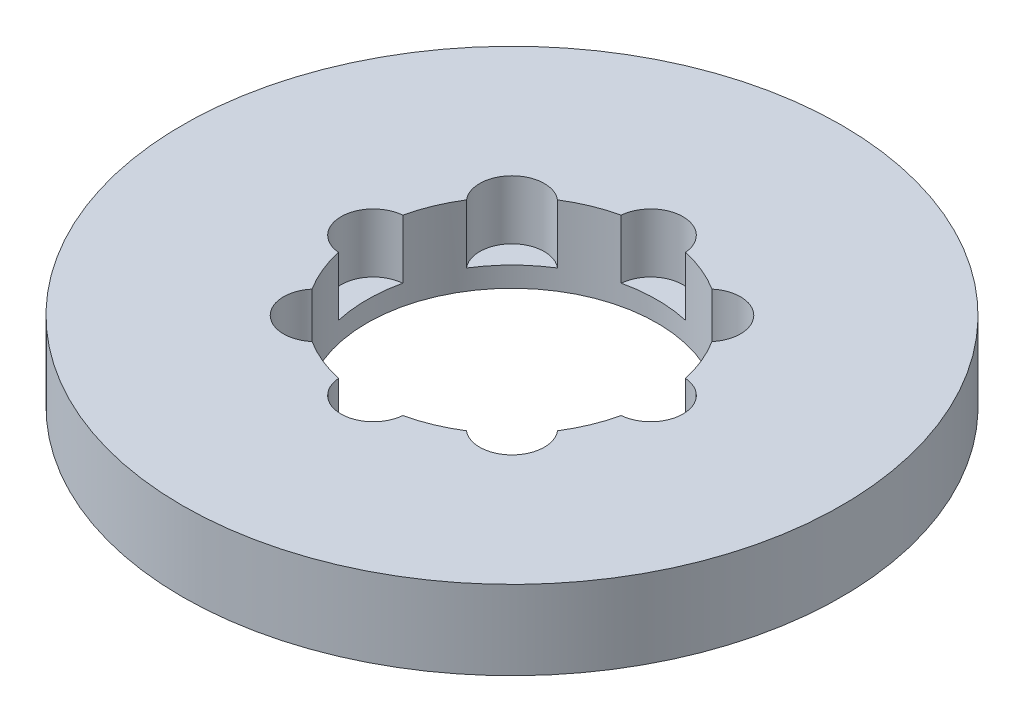
ISO-10303-21;
HEADER;
FILE_DESCRIPTION(('STEP AP214'),'2;1');
FILE_NAME('part.step','',(''),(''),'','','');
FILE_SCHEMA(('AUTOMOTIVE_DESIGN { 1 0 10303 214 1 1 1 1 }'));
ENDSEC;
DATA;
#1=APPLICATION_CONTEXT('core data for automotive mechanical design processes');
#2=APPLICATION_PROTOCOL_DEFINITION('international standard','automotive_design',2000,#1);
#3=PRODUCT_CONTEXT('',#1,'mechanical');
#4=PRODUCT('Part','Part','',(#3));
#5=PRODUCT_RELATED_PRODUCT_CATEGORY('part','',(#4));
#6=PRODUCT_DEFINITION_FORMATION('','',#4);
#7=PRODUCT_DEFINITION_CONTEXT('part definition',#1,'design');
#8=PRODUCT_DEFINITION('design','',#6,#7);
#9=PRODUCT_DEFINITION_SHAPE('','',#8);
#10=(LENGTH_UNIT() NAMED_UNIT(*) SI_UNIT(.MILLI.,.METRE.));
#11=(NAMED_UNIT(*) PLANE_ANGLE_UNIT() SI_UNIT($,.RADIAN.));
#12=(NAMED_UNIT(*) SI_UNIT($,.STERADIAN.) SOLID_ANGLE_UNIT());
#13=UNCERTAINTY_MEASURE_WITH_UNIT(LENGTH_MEASURE(1.E-05),#10,'distance_accuracy_value','');
#14=(GEOMETRIC_REPRESENTATION_CONTEXT(3) GLOBAL_UNCERTAINTY_ASSIGNED_CONTEXT((#13)) GLOBAL_UNIT_ASSIGNED_CONTEXT((#10,
#11,#12)) REPRESENTATION_CONTEXT('',''));
#15=CARTESIAN_POINT('',(0.,0.,0.));
#16=DIRECTION('',(0.,0.,1.));
#17=DIRECTION('',(1.,0.,0.));
#18=AXIS2_PLACEMENT_3D('',#15,#16,#17);
#19=CARTESIAN_POINT('',(0.,15.,0.));
#20=DIRECTION('',(0.,-1.,0.));
#21=DIRECTION('',(0.,0.,-1.));
#22=AXIS2_PLACEMENT_3D('',#19,#20,#21);
#23=CYLINDRICAL_SURFACE('',#22,62.5);
#24=CARTESIAN_POINT('',(0.,15.,0.));
#25=DIRECTION('',(0.,1.,0.));
#26=DIRECTION('',(0.,0.,1.));
#27=AXIS2_PLACEMENT_3D('',#24,#25,#26);
#28=CIRCLE('',#27,62.5);
#29=CARTESIAN_POINT('',(0.,15.,62.5));
#30=VERTEX_POINT('',#29);
#31=EDGE_CURVE('E183',#30,#30,#28,.T.);
#32=ORIENTED_EDGE('',*,*,#31,.F.);
#33=EDGE_LOOP('',(#32));
#34=FACE_BOUND('',#33,.T.);
#35=CARTESIAN_POINT('',(0.,0.,0.));
#36=DIRECTION('',(0.,1.,0.));
#37=DIRECTION('',(0.,0.,1.));
#38=AXIS2_PLACEMENT_3D('',#35,#36,#37);
#39=CIRCLE('',#38,62.5);
#40=CARTESIAN_POINT('',(0.,0.,62.5));
#41=VERTEX_POINT('',#40);
#42=EDGE_CURVE('E182',#41,#41,#39,.T.);
#43=ORIENTED_EDGE('',*,*,#42,.T.);
#44=EDGE_LOOP('',(#43));
#45=FACE_BOUND('',#44,.T.);
#46=ADVANCED_FACE('F39',(#34,#45),#23,.T.);
#47=CARTESIAN_POINT('',(0.,15.,0.));
#48=DIRECTION('',(0.,1.,0.));
#49=DIRECTION('',(0.,0.,1.));
#50=AXIS2_PLACEMENT_3D('',#47,#48,#49);
#51=PLANE('',#50);
#52=CARTESIAN_POINT('',(0.,15.,26.300983409731));
#53=DIRECTION('',(0.,1.,0.));
#54=DIRECTION('',(1.,0.,0.));
#55=AXIS2_PLACEMENT_3D('',#52,#53,#54);
#56=CIRCLE('',#55,6.12444442520899);
#57=CARTESIAN_POINT('',(-6.10289806772411,15.,26.8142617868732));
#58=VERTEX_POINT('',#57);
#59=CARTESIAN_POINT('',(6.10289806772429,15.,26.8142617868732));
#60=VERTEX_POINT('',#59);
#61=EDGE_CURVE('E256',#58,#60,#56,.T.);
#62=ORIENTED_EDGE('',*,*,#61,.F.);
#63=CARTESIAN_POINT('',(0.,15.,0.));
#64=DIRECTION('',(0.,1.,0.));
#65=DIRECTION('',(0.,0.,1.));
#66=AXIS2_PLACEMENT_3D('',#63,#64,#65);
#67=CIRCLE('',#66,27.5);
#68=CARTESIAN_POINT('',(-14.6451457334312,15.,23.2759469505874));
#69=VERTEX_POINT('',#68);
#70=EDGE_CURVE('E175',#69,#58,#67,.T.);
#71=ORIENTED_EDGE('',*,*,#70,.F.);
#72=CARTESIAN_POINT('',(-18.5976037208956,15.,18.5976037208957));
#73=DIRECTION('',(0.,1.,0.));
#74=DIRECTION('',(0.707106781186549,0.,0.707106781186546));
#75=AXIS2_PLACEMENT_3D('',#72,#73,#74);
#76=CIRCLE('',#75,6.12444442520899);
#77=CARTESIAN_POINT('',(-23.2759469505874,15.,14.6451457334313));
#78=VERTEX_POINT('',#77);
#79=EDGE_CURVE('E152',#78,#69,#76,.T.);
#80=ORIENTED_EDGE('',*,*,#79,.F.);
#81=CARTESIAN_POINT('',(-26.8142617868732,15.,6.1028980677242));
#82=VERTEX_POINT('',#81);
#83=EDGE_CURVE('E168',#82,#78,#67,.T.);
#84=ORIENTED_EDGE('',*,*,#83,.F.);
#85=CARTESIAN_POINT('',(-26.300983409731,15.,0.));
#86=DIRECTION('',(0.,1.,0.));
#87=DIRECTION('',(0.,0.,1.));
#88=AXIS2_PLACEMENT_3D('',#85,#86,#87);
#89=CIRCLE('',#88,6.12444442520899);
#90=CARTESIAN_POINT('',(-26.8142617868732,15.,-6.1028980677242));
#91=VERTEX_POINT('',#90);
#92=EDGE_CURVE('E205',#91,#82,#89,.T.);
#93=ORIENTED_EDGE('',*,*,#92,.F.);
#94=CARTESIAN_POINT('',(-23.2759469505876,15.,-14.645145733431));
#95=VERTEX_POINT('',#94);
#96=EDGE_CURVE('E181',#95,#91,#67,.T.);
#97=ORIENTED_EDGE('',*,*,#96,.F.);
#98=CARTESIAN_POINT('',(-18.5976037208959,15.,-18.5976037208955));
#99=DIRECTION('',(0.,1.,0.));
#100=DIRECTION('',(-0.707106781186539,0.,0.707106781186556));
#101=AXIS2_PLACEMENT_3D('',#98,#99,#100);
#102=CIRCLE('',#101,6.12444442520899);
#103=CARTESIAN_POINT('',(-14.6451457334316,15.,-23.2759469505872));
#104=VERTEX_POINT('',#103);
#105=EDGE_CURVE('E453',#104,#95,#102,.T.);
#106=ORIENTED_EDGE('',*,*,#105,.F.);
#107=CARTESIAN_POINT('',(-6.10289806772448,15.,-26.8142617868731));
#108=VERTEX_POINT('',#107);
#109=EDGE_CURVE('E189',#108,#104,#67,.T.);
#110=ORIENTED_EDGE('',*,*,#109,.F.);
#111=CARTESIAN_POINT('',(-2.75488178304896E-13,15.,-26.300983409731));
#112=DIRECTION('',(0.,1.,0.));
#113=DIRECTION('',(-1.,0.,0.));
#114=AXIS2_PLACEMENT_3D('',#111,#112,#113);
#115=CIRCLE('',#114,6.12444442520899);
#116=CARTESIAN_POINT('',(6.10289806772392,15.,-26.8142617868733));
#117=VERTEX_POINT('',#116);
#118=EDGE_CURVE('E462',#117,#108,#115,.T.);
#119=ORIENTED_EDGE('',*,*,#118,.F.);
#120=CARTESIAN_POINT('',(14.6451457334311,15.,-23.2759469505875));
#121=VERTEX_POINT('',#120);
#122=EDGE_CURVE('E197',#121,#117,#67,.T.);
#123=ORIENTED_EDGE('',*,*,#122,.F.);
#124=CARTESIAN_POINT('',(18.5976037208955,15.,-18.5976037208958));
#125=DIRECTION('',(0.,1.,0.));
#126=DIRECTION('',(-0.707106781186554,0.,-0.707106781186541));
#127=AXIS2_PLACEMENT_3D('',#124,#125,#126);
#128=CIRCLE('',#127,6.12444442520899);
#129=CARTESIAN_POINT('',(23.2759469505873,15.,-14.6451457334315));
#130=VERTEX_POINT('',#129);
#131=EDGE_CURVE('E470',#130,#121,#128,.T.);
#132=ORIENTED_EDGE('',*,*,#131,.F.);
#133=CARTESIAN_POINT('',(26.8142617868732,15.,-6.1028980677242));
#134=VERTEX_POINT('',#133);
#135=EDGE_CURVE('E489',#134,#130,#67,.T.);
#136=ORIENTED_EDGE('',*,*,#135,.F.);
#137=CARTESIAN_POINT('',(26.300983409731,15.,0.));
#138=DIRECTION('',(0.,1.,0.));
#139=DIRECTION('',(0.,0.,-1.));
#140=AXIS2_PLACEMENT_3D('',#137,#138,#139);
#141=CIRCLE('',#140,6.12444442520899);
#142=CARTESIAN_POINT('',(26.8142617868732,15.,6.1028980677242));
#143=VERTEX_POINT('',#142);
#144=EDGE_CURVE('E476',#143,#134,#141,.T.);
#145=ORIENTED_EDGE('',*,*,#144,.F.);
#146=CARTESIAN_POINT('',(23.2759469505875,15.,14.6451457334312));
#147=VERTEX_POINT('',#146);
#148=EDGE_CURVE('E491',#147,#143,#67,.T.);
#149=ORIENTED_EDGE('',*,*,#148,.F.);
#150=CARTESIAN_POINT('',(18.5976037208958,15.,18.5976037208956));
#151=DIRECTION('',(0.,1.,0.));
#152=DIRECTION('',(0.707106781186544,0.,-0.707106781186551));
#153=AXIS2_PLACEMENT_3D('',#150,#151,#152);
#154=CIRCLE('',#153,6.12444442520899);
#155=CARTESIAN_POINT('',(14.6451457334314,15.,23.2759469505873));
#156=VERTEX_POINT('',#155);
#157=EDGE_CURVE('E475',#156,#147,#154,.T.);
#158=ORIENTED_EDGE('',*,*,#157,.F.);
#159=EDGE_CURVE('E190',#60,#156,#67,.T.);
#160=ORIENTED_EDGE('',*,*,#159,.F.);
#161=EDGE_LOOP('',(#62,#71,#80,#84,#93,#97,#106,#110,#119,#123,#132,#136,#145,#149,#158,#160));
#162=FACE_BOUND('',#161,.T.);
#163=ORIENTED_EDGE('',*,*,#31,.T.);
#164=EDGE_LOOP('',(#163));
#165=FACE_BOUND('',#164,.T.);
#166=ADVANCED_FACE('F170',(#162,#165),#51,.T.);
#167=CARTESIAN_POINT('',(0.,0.,0.));
#168=DIRECTION('',(0.,1.,0.));
#169=DIRECTION('',(0.,0.,1.));
#170=AXIS2_PLACEMENT_3D('',#167,#168,#169);
#171=PLANE('',#170);
#172=CARTESIAN_POINT('',(0.,0.,0.));
#173=DIRECTION('',(0.,1.,0.));
#174=DIRECTION('',(0.,0.,1.));
#175=AXIS2_PLACEMENT_3D('',#172,#173,#174);
#176=CIRCLE('',#175,27.5);
#177=CARTESIAN_POINT('',(0.,0.,27.5));
#178=VERTEX_POINT('',#177);
#179=EDGE_CURVE('E191',#178,#178,#176,.T.);
#180=ORIENTED_EDGE('',*,*,#179,.T.);
#181=EDGE_LOOP('',(#180));
#182=FACE_BOUND('',#181,.T.);
#183=ORIENTED_EDGE('',*,*,#42,.F.);
#184=EDGE_LOOP('',(#183));
#185=FACE_BOUND('',#184,.T.);
#186=ADVANCED_FACE('F277',(#182,#185),#171,.F.);
#187=CARTESIAN_POINT('',(0.,15.,0.));
#188=DIRECTION('',(0.,-1.,0.));
#189=DIRECTION('',(0.,0.,-1.));
#190=AXIS2_PLACEMENT_3D('',#187,#188,#189);
#191=CYLINDRICAL_SURFACE('',#190,27.5);
#192=DIRECTION('',(0.,1.,0.));
#193=VECTOR('',#192,1.);
#194=CARTESIAN_POINT('',(-6.10289806772411,9.40940840713012,26.8142617868732));
#195=LINE('',#194,#193);
#196=CARTESIAN_POINT('',(-6.10289806772411,3.81881681426024,26.8142617868732));
#197=VERTEX_POINT('',#196);
#198=EDGE_CURVE('E11',#197,#58,#195,.T.);
#199=ORIENTED_EDGE('',*,*,#198,.F.);
#200=CARTESIAN_POINT('',(0.,3.81881681426024,0.));
#201=DIRECTION('',(0.,1.,0.));
#202=DIRECTION('',(0.,0.,1.));
#203=AXIS2_PLACEMENT_3D('',#200,#201,#202);
#204=CIRCLE('',#203,27.5);
#205=CARTESIAN_POINT('',(6.10289806772429,3.81881681426024,26.8142617868732));
#206=VERTEX_POINT('',#205);
#207=EDGE_CURVE('E251',#197,#206,#204,.T.);
#208=ORIENTED_EDGE('',*,*,#207,.T.);
#209=DIRECTION('',(0.,1.,0.));
#210=VECTOR('',#209,1.);
#211=CARTESIAN_POINT('',(6.10289806772429,9.40940840713012,26.8142617868732));
#212=LINE('',#211,#210);
#213=EDGE_CURVE('E46',#60,#206,#212,.F.);
#214=ORIENTED_EDGE('',*,*,#213,.F.);
#215=ORIENTED_EDGE('',*,*,#159,.T.);
#216=DIRECTION('',(0.,1.,0.));
#217=VECTOR('',#216,1.);
#218=CARTESIAN_POINT('',(14.6451457334314,9.40940840713012,23.2759469505873));
#219=LINE('',#218,#217);
#220=CARTESIAN_POINT('',(14.6451457334314,3.81881681426024,23.2759469505873));
#221=VERTEX_POINT('',#220);
#222=EDGE_CURVE('E253',#221,#156,#219,.T.);
#223=ORIENTED_EDGE('',*,*,#222,.F.);
#224=CARTESIAN_POINT('',(0.,3.81881681426024,0.));
#225=DIRECTION('',(0.,1.,0.));
#226=DIRECTION('',(0.,0.,1.));
#227=AXIS2_PLACEMENT_3D('',#224,#225,#226);
#228=CIRCLE('',#227,27.5);
#229=CARTESIAN_POINT('',(23.2759469505875,3.81881681426024,14.6451457334312));
#230=VERTEX_POINT('',#229);
#231=EDGE_CURVE('E246',#221,#230,#228,.T.);
#232=ORIENTED_EDGE('',*,*,#231,.T.);
#233=DIRECTION('',(0.,1.,0.));
#234=VECTOR('',#233,1.);
#235=CARTESIAN_POINT('',(23.2759469505875,9.40940840713012,14.6451457334312));
#236=LINE('',#235,#234);
#237=EDGE_CURVE('E248',#147,#230,#236,.F.);
#238=ORIENTED_EDGE('',*,*,#237,.F.);
#239=ORIENTED_EDGE('',*,*,#148,.T.);
#240=DIRECTION('',(0.,1.,0.));
#241=VECTOR('',#240,1.);
#242=CARTESIAN_POINT('',(26.8142617868732,9.40940840713012,6.1028980677242));
#243=LINE('',#242,#241);
#244=CARTESIAN_POINT('',(26.8142617868732,3.81881681426024,6.1028980677242));
#245=VERTEX_POINT('',#244);
#246=EDGE_CURVE('E243',#245,#143,#243,.T.);
#247=ORIENTED_EDGE('',*,*,#246,.F.);
#248=CARTESIAN_POINT('',(0.,3.81881681426024,0.));
#249=DIRECTION('',(0.,1.,0.));
#250=DIRECTION('',(0.,0.,1.));
#251=AXIS2_PLACEMENT_3D('',#248,#249,#250);
#252=CIRCLE('',#251,27.5);
#253=CARTESIAN_POINT('',(26.8142617868732,3.81881681426024,-6.1028980677242));
#254=VERTEX_POINT('',#253);
#255=EDGE_CURVE('E236',#245,#254,#252,.T.);
#256=ORIENTED_EDGE('',*,*,#255,.T.);
#257=DIRECTION('',(0.,1.,0.));
#258=VECTOR('',#257,1.);
#259=CARTESIAN_POINT('',(26.8142617868732,9.40940840713012,-6.1028980677242));
#260=LINE('',#259,#258);
#261=EDGE_CURVE('E241',#134,#254,#260,.F.);
#262=ORIENTED_EDGE('',*,*,#261,.F.);
#263=ORIENTED_EDGE('',*,*,#135,.T.);
#264=DIRECTION('',(0.,1.,0.));
#265=VECTOR('',#264,1.);
#266=CARTESIAN_POINT('',(23.2759469505873,9.40940840713012,-14.6451457334315));
#267=LINE('',#266,#265);
#268=CARTESIAN_POINT('',(23.2759469505873,3.81881681426024,-14.6451457334315));
#269=VERTEX_POINT('',#268);
#270=EDGE_CURVE('E237',#269,#130,#267,.T.);
#271=ORIENTED_EDGE('',*,*,#270,.F.);
#272=CARTESIAN_POINT('',(0.,3.81881681426024,0.));
#273=DIRECTION('',(0.,1.,0.));
#274=DIRECTION('',(0.,0.,1.));
#275=AXIS2_PLACEMENT_3D('',#272,#273,#274);
#276=CIRCLE('',#275,27.5);
#277=CARTESIAN_POINT('',(14.6451457334311,3.81881681426024,-23.2759469505875));
#278=VERTEX_POINT('',#277);
#279=EDGE_CURVE('E229',#269,#278,#276,.T.);
#280=ORIENTED_EDGE('',*,*,#279,.T.);
#281=DIRECTION('',(0.,1.,0.));
#282=VECTOR('',#281,1.);
#283=CARTESIAN_POINT('',(14.6451457334311,9.40940840713012,-23.2759469505875));
#284=LINE('',#283,#282);
#285=EDGE_CURVE('E232',#121,#278,#284,.F.);
#286=ORIENTED_EDGE('',*,*,#285,.F.);
#287=ORIENTED_EDGE('',*,*,#122,.T.);
#288=DIRECTION('',(0.,1.,0.));
#289=VECTOR('',#288,1.);
#290=CARTESIAN_POINT('',(6.10289806772392,9.40940840713012,-26.8142617868733));
#291=LINE('',#290,#289);
#292=CARTESIAN_POINT('',(6.10289806772392,3.81881681426024,-26.8142617868733));
#293=VERTEX_POINT('',#292);
#294=EDGE_CURVE('E227',#293,#117,#291,.T.);
#295=ORIENTED_EDGE('',*,*,#294,.F.);
#296=CARTESIAN_POINT('',(0.,3.81881681426024,0.));
#297=DIRECTION('',(0.,1.,0.));
#298=DIRECTION('',(0.,0.,1.));
#299=AXIS2_PLACEMENT_3D('',#296,#297,#298);
#300=CIRCLE('',#299,27.5);
#301=CARTESIAN_POINT('',(-6.10289806772448,3.81881681426024,-26.8142617868731));
#302=VERTEX_POINT('',#301);
#303=EDGE_CURVE('E225',#293,#302,#300,.T.);
#304=ORIENTED_EDGE('',*,*,#303,.T.);
#305=DIRECTION('',(0.,1.,0.));
#306=VECTOR('',#305,1.);
#307=CARTESIAN_POINT('',(-6.10289806772448,9.40940840713012,-26.8142617868731));
#308=LINE('',#307,#306);
#309=EDGE_CURVE('E223',#108,#302,#308,.F.);
#310=ORIENTED_EDGE('',*,*,#309,.F.);
#311=ORIENTED_EDGE('',*,*,#109,.T.);
#312=DIRECTION('',(0.,1.,0.));
#313=VECTOR('',#312,1.);
#314=CARTESIAN_POINT('',(-14.6451457334316,9.40940840713012,-23.2759469505872));
#315=LINE('',#314,#313);
#316=CARTESIAN_POINT('',(-14.6451457334316,3.81881681426024,-23.2759469505872));
#317=VERTEX_POINT('',#316);
#318=EDGE_CURVE('E219',#317,#104,#315,.T.);
#319=ORIENTED_EDGE('',*,*,#318,.F.);
#320=CARTESIAN_POINT('',(0.,3.81881681426024,0.));
#321=DIRECTION('',(0.,1.,0.));
#322=DIRECTION('',(0.,0.,1.));
#323=AXIS2_PLACEMENT_3D('',#320,#321,#322);
#324=CIRCLE('',#323,27.5);
#325=CARTESIAN_POINT('',(-23.2759469505876,3.81881681426024,-14.645145733431));
#326=VERTEX_POINT('',#325);
#327=EDGE_CURVE('E159',#317,#326,#324,.T.);
#328=ORIENTED_EDGE('',*,*,#327,.T.);
#329=DIRECTION('',(0.,1.,0.));
#330=VECTOR('',#329,1.);
#331=CARTESIAN_POINT('',(-23.2759469505876,9.40940840713012,-14.645145733431));
#332=LINE('',#331,#330);
#333=EDGE_CURVE('E220',#95,#326,#332,.F.);
#334=ORIENTED_EDGE('',*,*,#333,.F.);
#335=ORIENTED_EDGE('',*,*,#96,.T.);
#336=DIRECTION('',(0.,1.,0.));
#337=VECTOR('',#336,1.);
#338=CARTESIAN_POINT('',(-26.8142617868732,9.40940840713012,-6.1028980677242));
#339=LINE('',#338,#337);
#340=CARTESIAN_POINT('',(-26.8142617868732,3.81881681426024,-6.1028980677242));
#341=VERTEX_POINT('',#340);
#342=EDGE_CURVE('E209',#341,#91,#339,.T.);
#343=ORIENTED_EDGE('',*,*,#342,.F.);
#344=CARTESIAN_POINT('',(0.,3.81881681426024,0.));
#345=DIRECTION('',(0.,1.,0.));
#346=DIRECTION('',(0.,0.,1.));
#347=AXIS2_PLACEMENT_3D('',#344,#345,#346);
#348=CIRCLE('',#347,27.5);
#349=CARTESIAN_POINT('',(-26.8142617868732,3.81881681426024,6.1028980677242));
#350=VERTEX_POINT('',#349);
#351=EDGE_CURVE('E206',#341,#350,#348,.T.);
#352=ORIENTED_EDGE('',*,*,#351,.T.);
#353=DIRECTION('',(0.,1.,0.));
#354=VECTOR('',#353,1.);
#355=CARTESIAN_POINT('',(-26.8142617868732,9.40940840713012,6.1028980677242));
#356=LINE('',#355,#354);
#357=EDGE_CURVE('E179',#82,#350,#356,.F.);
#358=ORIENTED_EDGE('',*,*,#357,.F.);
#359=ORIENTED_EDGE('',*,*,#83,.T.);
#360=DIRECTION('',(0.,1.,0.));
#361=VECTOR('',#360,1.);
#362=CARTESIAN_POINT('',(-23.2759469505874,9.40940840713012,14.6451457334313));
#363=LINE('',#362,#361);
#364=CARTESIAN_POINT('',(-23.2759469505874,3.81881681426024,14.6451457334313));
#365=VERTEX_POINT('',#364);
#366=EDGE_CURVE('E147',#365,#78,#363,.T.);
#367=ORIENTED_EDGE('',*,*,#366,.F.);
#368=CARTESIAN_POINT('',(0.,3.81881681426024,0.));
#369=DIRECTION('',(0.,1.,0.));
#370=DIRECTION('',(0.,0.,1.));
#371=AXIS2_PLACEMENT_3D('',#368,#369,#370);
#372=CIRCLE('',#371,27.5);
#373=CARTESIAN_POINT('',(-14.6451457334312,3.81881681426024,23.2759469505874));
#374=VERTEX_POINT('',#373);
#375=EDGE_CURVE('E215',#365,#374,#372,.T.);
#376=ORIENTED_EDGE('',*,*,#375,.T.);
#377=DIRECTION('',(0.,1.,0.));
#378=VECTOR('',#377,1.);
#379=CARTESIAN_POINT('',(-14.6451457334312,9.40940840713012,23.2759469505874));
#380=LINE('',#379,#378);
#381=EDGE_CURVE('E161',#69,#374,#380,.F.);
#382=ORIENTED_EDGE('',*,*,#381,.F.);
#383=ORIENTED_EDGE('',*,*,#70,.T.);
#384=EDGE_LOOP('',(#199,#208,#214,#215,#223,#232,#238,#239,#247,#256,#262,#263,#271,#280,#286,
#287,#295,#304,#310,#311,#319,#328,#334,#335,#343,#352,#358,#359,#367,#376,#382,#383));
#385=FACE_BOUND('',#384,.T.);
#386=ORIENTED_EDGE('',*,*,#179,.F.);
#387=EDGE_LOOP('',(#386));
#388=FACE_BOUND('',#387,.T.);
#389=ADVANCED_FACE('F176',(#385,#388),#191,.F.);
#390=CARTESIAN_POINT('',(-26.300983409731,3.81881681426024,0.));
#391=DIRECTION('',(0.,1.,0.));
#392=DIRECTION('',(0.,0.,1.));
#393=AXIS2_PLACEMENT_3D('',#390,#391,#392);
#394=CYLINDRICAL_SURFACE('',#393,6.12444442520899);
#395=ORIENTED_EDGE('',*,*,#342,.T.);
#396=ORIENTED_EDGE('',*,*,#92,.T.);
#397=ORIENTED_EDGE('',*,*,#357,.T.);
#398=CARTESIAN_POINT('',(-26.300983409731,3.81881681426024,0.));
#399=DIRECTION('',(0.,1.,0.));
#400=DIRECTION('',(0.,0.,1.));
#401=AXIS2_PLACEMENT_3D('',#398,#399,#400);
#402=CIRCLE('',#401,6.12444442520899);
#403=EDGE_CURVE('E200',#341,#350,#402,.T.);
#404=ORIENTED_EDGE('',*,*,#403,.F.);
#405=EDGE_LOOP('',(#395,#396,#397,#404));
#406=FACE_BOUND('',#405,.T.);
#407=ADVANCED_FACE('F286',(#406),#394,.F.);
#408=CARTESIAN_POINT('',(-26.300983409731,3.81881681426024,0.));
#409=DIRECTION('',(0.,1.,0.));
#410=DIRECTION('',(0.,0.,1.));
#411=AXIS2_PLACEMENT_3D('',#408,#409,#410);
#412=PLANE('',#411);
#413=ORIENTED_EDGE('',*,*,#403,.T.);
#414=ORIENTED_EDGE('',*,*,#351,.F.);
#415=EDGE_LOOP('',(#413,#414));
#416=FACE_BOUND('',#415,.T.);
#417=ADVANCED_FACE('F289',(#416),#412,.T.);
#418=CARTESIAN_POINT('',(-18.5976037208956,3.81881681426024,18.5976037208957));
#419=DIRECTION('',(0.,1.,0.));
#420=DIRECTION('',(0.,0.,1.));
#421=AXIS2_PLACEMENT_3D('',#418,#419,#420);
#422=CYLINDRICAL_SURFACE('',#421,6.12444442520899);
#423=ORIENTED_EDGE('',*,*,#366,.T.);
#424=ORIENTED_EDGE('',*,*,#79,.T.);
#425=ORIENTED_EDGE('',*,*,#381,.T.);
#426=CARTESIAN_POINT('',(-18.5976037208956,3.81881681426024,18.5976037208957));
#427=DIRECTION('',(0.,1.,0.));
#428=DIRECTION('',(0.707106781186549,0.,0.707106781186546));
#429=AXIS2_PLACEMENT_3D('',#426,#427,#428);
#430=CIRCLE('',#429,6.12444442520899);
#431=EDGE_CURVE('E156',#365,#374,#430,.T.);
#432=ORIENTED_EDGE('',*,*,#431,.F.);
#433=EDGE_LOOP('',(#423,#424,#425,#432));
#434=FACE_BOUND('',#433,.T.);
#435=ADVANCED_FACE('F155',(#434),#422,.F.);
#436=CARTESIAN_POINT('',(-18.5976037208956,3.81881681426024,18.5976037208957));
#437=DIRECTION('',(0.,1.,0.));
#438=DIRECTION('',(0.707106781186549,0.,0.707106781186546));
#439=AXIS2_PLACEMENT_3D('',#436,#437,#438);
#440=PLANE('',#439);
#441=ORIENTED_EDGE('',*,*,#431,.T.);
#442=ORIENTED_EDGE('',*,*,#375,.F.);
#443=EDGE_LOOP('',(#441,#442));
#444=FACE_BOUND('',#443,.T.);
#445=ADVANCED_FACE('F300',(#444),#440,.T.);
#446=CARTESIAN_POINT('',(-18.5976037208959,3.81881681426024,-18.5976037208955));
#447=DIRECTION('',(0.,1.,0.));
#448=DIRECTION('',(0.,0.,1.));
#449=AXIS2_PLACEMENT_3D('',#446,#447,#448);
#450=CYLINDRICAL_SURFACE('',#449,6.12444442520899);
#451=ORIENTED_EDGE('',*,*,#318,.T.);
#452=ORIENTED_EDGE('',*,*,#105,.T.);
#453=ORIENTED_EDGE('',*,*,#333,.T.);
#454=CARTESIAN_POINT('',(-18.5976037208959,3.81881681426024,-18.5976037208955));
#455=DIRECTION('',(0.,1.,0.));
#456=DIRECTION('',(-0.707106781186539,0.,0.707106781186556));
#457=AXIS2_PLACEMENT_3D('',#454,#455,#456);
#458=CIRCLE('',#457,6.12444442520899);
#459=EDGE_CURVE('E454',#317,#326,#458,.T.);
#460=ORIENTED_EDGE('',*,*,#459,.F.);
#461=EDGE_LOOP('',(#451,#452,#453,#460));
#462=FACE_BOUND('',#461,.T.);
#463=ADVANCED_FACE('F299',(#462),#450,.F.);
#464=CARTESIAN_POINT('',(-18.5976037208959,3.81881681426024,-18.5976037208955));
#465=DIRECTION('',(0.,1.,0.));
#466=DIRECTION('',(-0.707106781186539,0.,0.707106781186556));
#467=AXIS2_PLACEMENT_3D('',#464,#465,#466);
#468=PLANE('',#467);
#469=ORIENTED_EDGE('',*,*,#459,.T.);
#470=ORIENTED_EDGE('',*,*,#327,.F.);
#471=EDGE_LOOP('',(#469,#470));
#472=FACE_BOUND('',#471,.T.);
#473=ADVANCED_FACE('F379',(#472),#468,.T.);
#474=CARTESIAN_POINT('',(-2.75488178304896E-13,3.81881681426024,-26.300983409731));
#475=DIRECTION('',(0.,1.,0.));
#476=DIRECTION('',(0.,0.,1.));
#477=AXIS2_PLACEMENT_3D('',#474,#475,#476);
#478=CYLINDRICAL_SURFACE('',#477,6.12444442520899);
#479=ORIENTED_EDGE('',*,*,#294,.T.);
#480=ORIENTED_EDGE('',*,*,#118,.T.);
#481=ORIENTED_EDGE('',*,*,#309,.T.);
#482=CARTESIAN_POINT('',(-2.75488178304896E-13,3.81881681426024,-26.300983409731));
#483=DIRECTION('',(0.,1.,0.));
#484=DIRECTION('',(-1.,0.,0.));
#485=AXIS2_PLACEMENT_3D('',#482,#483,#484);
#486=CIRCLE('',#485,6.12444442520899);
#487=EDGE_CURVE('E465',#293,#302,#486,.T.);
#488=ORIENTED_EDGE('',*,*,#487,.F.);
#489=EDGE_LOOP('',(#479,#480,#481,#488));
#490=FACE_BOUND('',#489,.T.);
#491=ADVANCED_FACE('F371',(#490),#478,.F.);
#492=CARTESIAN_POINT('',(-2.75488178304896E-13,3.81881681426024,-26.300983409731));
#493=DIRECTION('',(0.,1.,0.));
#494=DIRECTION('',(-1.,0.,0.));
#495=AXIS2_PLACEMENT_3D('',#492,#493,#494);
#496=PLANE('',#495);
#497=ORIENTED_EDGE('',*,*,#487,.T.);
#498=ORIENTED_EDGE('',*,*,#303,.F.);
#499=EDGE_LOOP('',(#497,#498));
#500=FACE_BOUND('',#499,.T.);
#501=ADVANCED_FACE('F308',(#500),#496,.T.);
#502=CARTESIAN_POINT('',(18.5976037208955,3.81881681426024,-18.5976037208958));
#503=DIRECTION('',(0.,1.,0.));
#504=DIRECTION('',(0.,0.,1.));
#505=AXIS2_PLACEMENT_3D('',#502,#503,#504);
#506=CYLINDRICAL_SURFACE('',#505,6.12444442520899);
#507=ORIENTED_EDGE('',*,*,#270,.T.);
#508=ORIENTED_EDGE('',*,*,#131,.T.);
#509=ORIENTED_EDGE('',*,*,#285,.T.);
#510=CARTESIAN_POINT('',(18.5976037208955,3.81881681426024,-18.5976037208958));
#511=DIRECTION('',(0.,1.,0.));
#512=DIRECTION('',(-0.707106781186554,0.,-0.707106781186541));
#513=AXIS2_PLACEMENT_3D('',#510,#511,#512);
#514=CIRCLE('',#513,6.12444442520899);
#515=EDGE_CURVE('E477',#269,#278,#514,.T.);
#516=ORIENTED_EDGE('',*,*,#515,.F.);
#517=EDGE_LOOP('',(#507,#508,#509,#516));
#518=FACE_BOUND('',#517,.T.);
#519=ADVANCED_FACE('F305',(#518),#506,.F.);
#520=CARTESIAN_POINT('',(18.5976037208955,3.81881681426024,-18.5976037208958));
#521=DIRECTION('',(0.,1.,0.));
#522=DIRECTION('',(-0.707106781186554,0.,-0.707106781186541));
#523=AXIS2_PLACEMENT_3D('',#520,#521,#522);
#524=PLANE('',#523);
#525=ORIENTED_EDGE('',*,*,#515,.T.);
#526=ORIENTED_EDGE('',*,*,#279,.F.);
#527=EDGE_LOOP('',(#525,#526));
#528=FACE_BOUND('',#527,.T.);
#529=ADVANCED_FACE('F304',(#528),#524,.T.);
#530=CARTESIAN_POINT('',(26.300983409731,3.81881681426024,0.));
#531=DIRECTION('',(0.,1.,0.));
#532=DIRECTION('',(0.,0.,1.));
#533=AXIS2_PLACEMENT_3D('',#530,#531,#532);
#534=CYLINDRICAL_SURFACE('',#533,6.12444442520899);
#535=ORIENTED_EDGE('',*,*,#246,.T.);
#536=ORIENTED_EDGE('',*,*,#144,.T.);
#537=ORIENTED_EDGE('',*,*,#261,.T.);
#538=CARTESIAN_POINT('',(26.300983409731,3.81881681426024,0.));
#539=DIRECTION('',(0.,1.,0.));
#540=DIRECTION('',(0.,0.,-1.));
#541=AXIS2_PLACEMENT_3D('',#538,#539,#540);
#542=CIRCLE('',#541,6.12444442520899);
#543=EDGE_CURVE('E478',#245,#254,#542,.T.);
#544=ORIENTED_EDGE('',*,*,#543,.F.);
#545=EDGE_LOOP('',(#535,#536,#537,#544));
#546=FACE_BOUND('',#545,.T.);
#547=ADVANCED_FACE('F309',(#546),#534,.F.);
#548=CARTESIAN_POINT('',(26.300983409731,3.81881681426024,0.));
#549=DIRECTION('',(0.,1.,0.));
#550=DIRECTION('',(0.,0.,-1.));
#551=AXIS2_PLACEMENT_3D('',#548,#549,#550);
#552=PLANE('',#551);
#553=ORIENTED_EDGE('',*,*,#543,.T.);
#554=ORIENTED_EDGE('',*,*,#255,.F.);
#555=EDGE_LOOP('',(#553,#554));
#556=FACE_BOUND('',#555,.T.);
#557=ADVANCED_FACE('F314',(#556),#552,.T.);
#558=CARTESIAN_POINT('',(18.5976037208958,3.81881681426024,18.5976037208956));
#559=DIRECTION('',(0.,1.,0.));
#560=DIRECTION('',(0.,0.,1.));
#561=AXIS2_PLACEMENT_3D('',#558,#559,#560);
#562=CYLINDRICAL_SURFACE('',#561,6.12444442520899);
#563=ORIENTED_EDGE('',*,*,#222,.T.);
#564=ORIENTED_EDGE('',*,*,#157,.T.);
#565=ORIENTED_EDGE('',*,*,#237,.T.);
#566=CARTESIAN_POINT('',(18.5976037208958,3.81881681426024,18.5976037208956));
#567=DIRECTION('',(0.,1.,0.));
#568=DIRECTION('',(0.707106781186544,0.,-0.707106781186551));
#569=AXIS2_PLACEMENT_3D('',#566,#567,#568);
#570=CIRCLE('',#569,6.12444442520899);
#571=EDGE_CURVE('E56',#221,#230,#570,.T.);
#572=ORIENTED_EDGE('',*,*,#571,.F.);
#573=EDGE_LOOP('',(#563,#564,#565,#572));
#574=FACE_BOUND('',#573,.T.);
#575=ADVANCED_FACE('F318',(#574),#562,.F.);
#576=CARTESIAN_POINT('',(18.5976037208958,3.81881681426024,18.5976037208956));
#577=DIRECTION('',(0.,1.,0.));
#578=DIRECTION('',(0.707106781186544,0.,-0.707106781186551));
#579=AXIS2_PLACEMENT_3D('',#576,#577,#578);
#580=PLANE('',#579);
#581=ORIENTED_EDGE('',*,*,#571,.T.);
#582=ORIENTED_EDGE('',*,*,#231,.F.);
#583=EDGE_LOOP('',(#581,#582));
#584=FACE_BOUND('',#583,.T.);
#585=ADVANCED_FACE('F270',(#584),#580,.T.);
#586=CARTESIAN_POINT('',(0.,3.81881681426024,26.300983409731));
#587=DIRECTION('',(0.,1.,0.));
#588=DIRECTION('',(0.,0.,1.));
#589=AXIS2_PLACEMENT_3D('',#586,#587,#588);
#590=CYLINDRICAL_SURFACE('',#589,6.12444442520899);
#591=ORIENTED_EDGE('',*,*,#198,.T.);
#592=ORIENTED_EDGE('',*,*,#61,.T.);
#593=ORIENTED_EDGE('',*,*,#213,.T.);
#594=CARTESIAN_POINT('',(0.,3.81881681426024,26.300983409731));
#595=DIRECTION('',(0.,1.,0.));
#596=DIRECTION('',(1.,0.,0.));
#597=AXIS2_PLACEMENT_3D('',#594,#595,#596);
#598=CIRCLE('',#597,6.12444442520899);
#599=EDGE_CURVE('E55',#197,#206,#598,.T.);
#600=ORIENTED_EDGE('',*,*,#599,.F.);
#601=EDGE_LOOP('',(#591,#592,#593,#600));
#602=FACE_BOUND('',#601,.T.);
#603=ADVANCED_FACE('F260',(#602),#590,.F.);
#604=CARTESIAN_POINT('',(0.,3.81881681426024,26.300983409731));
#605=DIRECTION('',(0.,1.,0.));
#606=DIRECTION('',(1.,0.,0.));
#607=AXIS2_PLACEMENT_3D('',#604,#605,#606);
#608=PLANE('',#607);
#609=ORIENTED_EDGE('',*,*,#599,.T.);
#610=ORIENTED_EDGE('',*,*,#207,.F.);
#611=EDGE_LOOP('',(#609,#610));
#612=FACE_BOUND('',#611,.T.);
#613=ADVANCED_FACE('F261',(#612),#608,.T.);
#614=CLOSED_SHELL('',(#46,#166,#186,#389,#407,#417,#435,#445,#463,#473,#491,#501,#519,#529,#547,
#557,#575,#585,#603,#613));
#615=MANIFOLD_SOLID_BREP('B2',#614);
#616=ADVANCED_BREP_SHAPE_REPRESENTATION('',(#18,#615),#14);
#617=SHAPE_DEFINITION_REPRESENTATION(#9,#616);
ENDSEC;
END-ISO-10303-21;
